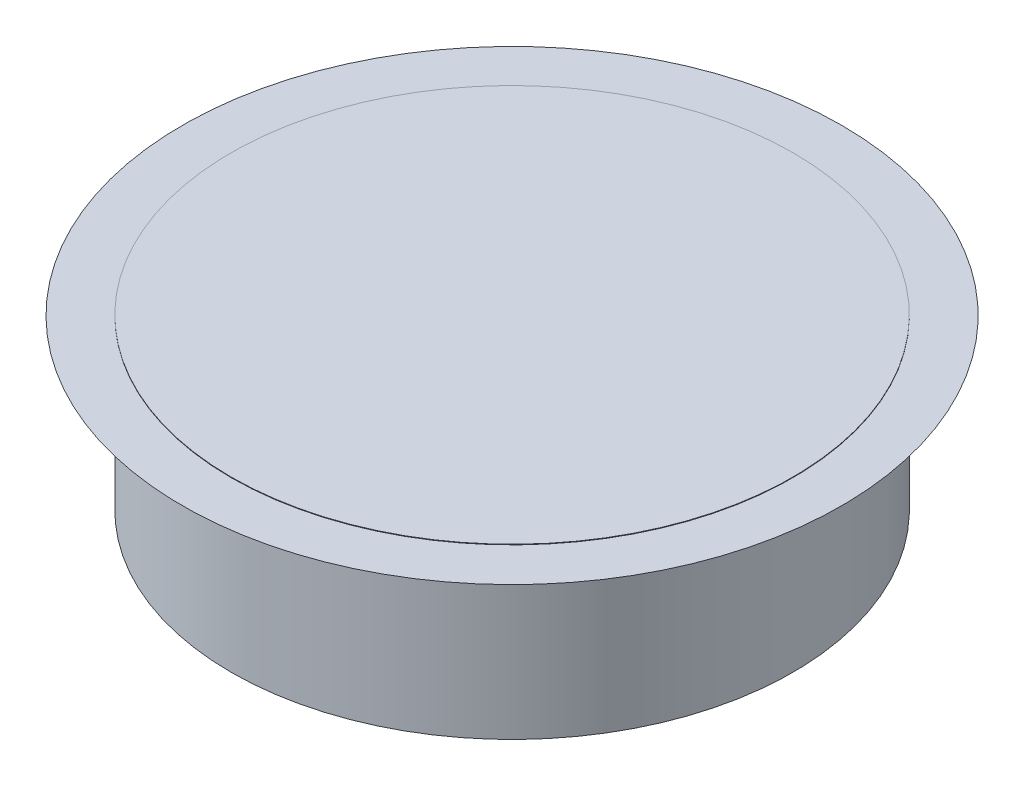
ISO-10303-21;
HEADER;
FILE_DESCRIPTION(('STEP AP214'),'2;1');
FILE_NAME('part.step','',(''),(''),'','','');
FILE_SCHEMA(('AUTOMOTIVE_DESIGN { 1 0 10303 214 1 1 1 1 }'));
ENDSEC;
DATA;
#1=APPLICATION_CONTEXT('core data for automotive mechanical design processes');
#2=APPLICATION_PROTOCOL_DEFINITION('international standard','automotive_design',2000,#1);
#3=PRODUCT_CONTEXT('',#1,'mechanical');
#4=PRODUCT('Part','Part','',(#3));
#5=PRODUCT_RELATED_PRODUCT_CATEGORY('part','',(#4));
#6=PRODUCT_DEFINITION_FORMATION('','',#4);
#7=PRODUCT_DEFINITION_CONTEXT('part definition',#1,'design');
#8=PRODUCT_DEFINITION('design','',#6,#7);
#9=PRODUCT_DEFINITION_SHAPE('','',#8);
#10=(LENGTH_UNIT() NAMED_UNIT(*) SI_UNIT(.MILLI.,.METRE.));
#11=(NAMED_UNIT(*) PLANE_ANGLE_UNIT() SI_UNIT($,.RADIAN.));
#12=(NAMED_UNIT(*) SI_UNIT($,.STERADIAN.) SOLID_ANGLE_UNIT());
#13=UNCERTAINTY_MEASURE_WITH_UNIT(LENGTH_MEASURE(1.E-05),#10,'distance_accuracy_value','');
#14=(GEOMETRIC_REPRESENTATION_CONTEXT(3) GLOBAL_UNCERTAINTY_ASSIGNED_CONTEXT((#13)) GLOBAL_UNIT_ASSIGNED_CONTEXT((#10,
#11,#12)) REPRESENTATION_CONTEXT('',''));
#15=CARTESIAN_POINT('',(0.,0.,0.));
#16=DIRECTION('',(0.,0.,1.));
#17=DIRECTION('',(1.,0.,0.));
#18=AXIS2_PLACEMENT_3D('',#15,#16,#17);
#19=CARTESIAN_POINT('',(0.,0.,0.));
#20=DIRECTION('',(0.,1.,0.));
#21=DIRECTION('',(0.,0.,1.));
#22=AXIS2_PLACEMENT_3D('',#19,#20,#21);
#23=PLANE('',#22);
#24=CARTESIAN_POINT('',(0.,0.,0.));
#25=DIRECTION('',(0.,-1.,0.));
#26=DIRECTION('',(0.,0.,-1.));
#27=AXIS2_PLACEMENT_3D('',#24,#25,#26);
#28=CIRCLE('',#27,12.7);
#29=CARTESIAN_POINT('',(0.,0.,-12.7));
#30=VERTEX_POINT('',#29);
#31=EDGE_CURVE('E42',#30,#30,#28,.T.);
#32=ORIENTED_EDGE('',*,*,#31,.T.);
#33=EDGE_LOOP('',(#32));
#34=FACE_BOUND('',#33,.T.);
#35=ADVANCED_FACE('F39',(#34),#23,.F.);
#36=CARTESIAN_POINT('',(0.,0.,0.));
#37=DIRECTION('',(0.,-1.,0.));
#38=DIRECTION('',(0.,0.,-1.));
#39=AXIS2_PLACEMENT_3D('',#36,#37,#38);
#40=CYLINDRICAL_SURFACE('',#39,12.7);
#41=ORIENTED_EDGE('',*,*,#31,.F.);
#42=EDGE_LOOP('',(#41));
#43=FACE_BOUND('',#42,.T.);
#44=CARTESIAN_POINT('',(0.,6.35,0.));
#45=DIRECTION('',(0.,-1.,0.));
#46=DIRECTION('',(0.,0.,-1.));
#47=AXIS2_PLACEMENT_3D('',#44,#45,#46);
#48=CIRCLE('',#47,12.7);
#49=CARTESIAN_POINT('',(0.,6.35,-12.7));
#50=VERTEX_POINT('',#49);
#51=EDGE_CURVE('E50',#50,#50,#48,.T.);
#52=ORIENTED_EDGE('',*,*,#51,.T.);
#53=EDGE_LOOP('',(#52));
#54=FACE_BOUND('',#53,.T.);
#55=ADVANCED_FACE('F59',(#43,#54),#40,.T.);
#56=CARTESIAN_POINT('',(0.,7.62,0.));
#57=DIRECTION('',(0.,1.,0.));
#58=DIRECTION('',(0.,0.,1.));
#59=AXIS2_PLACEMENT_3D('',#56,#57,#58);
#60=CONICAL_SURFACE('',#59,14.8997045256125,1.0471975511966);
#61=ORIENTED_EDGE('',*,*,#51,.F.);
#62=EDGE_LOOP('',(#61));
#63=FACE_BOUND('',#62,.T.);
#64=CARTESIAN_POINT('',(0.,7.62,0.));
#65=DIRECTION('',(0.,-1.,0.));
#66=DIRECTION('',(0.,0.,-1.));
#67=AXIS2_PLACEMENT_3D('',#64,#65,#66);
#68=CIRCLE('',#67,14.8997045256125);
#69=CARTESIAN_POINT('',(0.,7.62,-14.8997045256125));
#70=VERTEX_POINT('',#69);
#71=EDGE_CURVE('E54',#70,#70,#68,.T.);
#72=ORIENTED_EDGE('',*,*,#71,.T.);
#73=EDGE_LOOP('',(#72));
#74=FACE_BOUND('',#73,.T.);
#75=ADVANCED_FACE('F61',(#63,#74),#60,.T.);
#76=CARTESIAN_POINT('',(-14.8997045256125,7.62,0.));
#77=DIRECTION('',(0.,-1.,0.));
#78=DIRECTION('',(0.,0.,-1.));
#79=AXIS2_PLACEMENT_3D('',#76,#77,#78);
#80=PLANE('',#79);
#81=CARTESIAN_POINT('',(0.,7.62,0.));
#82=DIRECTION('',(0.,1.,0.));
#83=DIRECTION('',(0.,0.,1.));
#84=AXIS2_PLACEMENT_3D('',#81,#82,#83);
#85=CIRCLE('',#84,12.7);
#86=CARTESIAN_POINT('',(0.,7.62,12.7));
#87=VERTEX_POINT('',#86);
#88=EDGE_CURVE('E10',#87,#87,#85,.T.);
#89=ORIENTED_EDGE('',*,*,#88,.F.);
#90=EDGE_LOOP('',(#89));
#91=FACE_BOUND('',#90,.T.);
#92=ORIENTED_EDGE('',*,*,#71,.F.);
#93=EDGE_LOOP('',(#92));
#94=FACE_BOUND('',#93,.T.);
#95=ADVANCED_FACE('F64',(#91,#94),#80,.F.);
#96=CARTESIAN_POINT('',(0.,7.6454,0.));
#97=DIRECTION('',(0.,-1.,0.));
#98=DIRECTION('',(0.,0.,-1.));
#99=AXIS2_PLACEMENT_3D('',#96,#97,#98);
#100=CYLINDRICAL_SURFACE('',#99,12.7);
#101=CARTESIAN_POINT('',(0.,7.6454,0.));
#102=DIRECTION('',(0.,1.,0.));
#103=DIRECTION('',(0.,0.,1.));
#104=AXIS2_PLACEMENT_3D('',#101,#102,#103);
#105=CIRCLE('',#104,12.7);
#106=CARTESIAN_POINT('',(0.,7.6454,12.7));
#107=VERTEX_POINT('',#106);
#108=EDGE_CURVE('E53',#107,#107,#105,.T.);
#109=ORIENTED_EDGE('',*,*,#108,.F.);
#110=EDGE_LOOP('',(#109));
#111=FACE_BOUND('',#110,.T.);
#112=ORIENTED_EDGE('',*,*,#88,.T.);
#113=EDGE_LOOP('',(#112));
#114=FACE_BOUND('',#113,.T.);
#115=ADVANCED_FACE('F69',(#111,#114),#100,.T.);
#116=CARTESIAN_POINT('',(0.,7.6454,0.));
#117=DIRECTION('',(0.,1.,0.));
#118=DIRECTION('',(0.,0.,1.));
#119=AXIS2_PLACEMENT_3D('',#116,#117,#118);
#120=PLANE('',#119);
#121=ORIENTED_EDGE('',*,*,#108,.T.);
#122=EDGE_LOOP('',(#121));
#123=FACE_BOUND('',#122,.T.);
#124=ADVANCED_FACE('F75',(#123),#120,.T.);
#125=CLOSED_SHELL('',(#35,#55,#75,#95,#115,#124));
#126=MANIFOLD_SOLID_BREP('B2',#125);
#127=ADVANCED_BREP_SHAPE_REPRESENTATION('',(#18,#126),#14);
#128=SHAPE_DEFINITION_REPRESENTATION(#9,#127);
ENDSEC;
END-ISO-10303-21;
